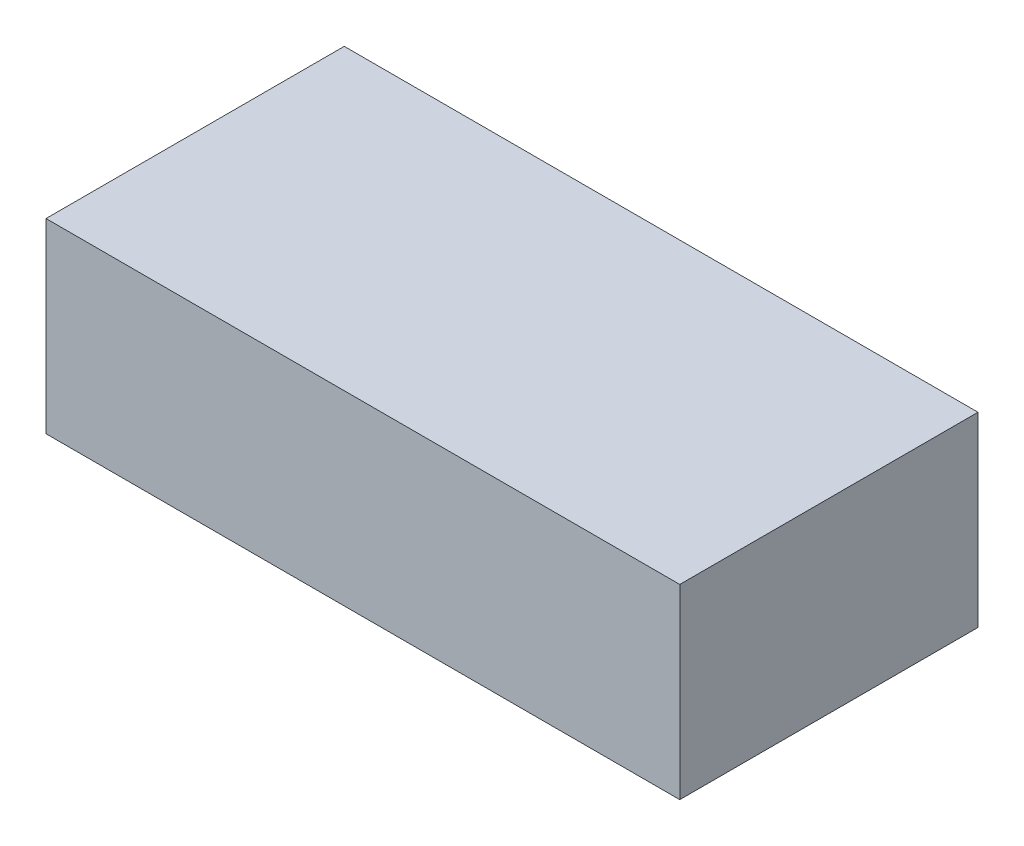
ISO-10303-21;
HEADER;
FILE_DESCRIPTION(('STEP AP214'),'2;1');
FILE_NAME('part.step','',(''),(''),'','','');
FILE_SCHEMA(('AUTOMOTIVE_DESIGN { 1 0 10303 214 1 1 1 1 }'));
ENDSEC;
DATA;
#1=APPLICATION_CONTEXT('core data for automotive mechanical design processes');
#2=APPLICATION_PROTOCOL_DEFINITION('international standard','automotive_design',2000,#1);
#3=PRODUCT_CONTEXT('',#1,'mechanical');
#4=PRODUCT('Part','Part','',(#3));
#5=PRODUCT_RELATED_PRODUCT_CATEGORY('part','',(#4));
#6=PRODUCT_DEFINITION_FORMATION('','',#4);
#7=PRODUCT_DEFINITION_CONTEXT('part definition',#1,'design');
#8=PRODUCT_DEFINITION('design','',#6,#7);
#9=PRODUCT_DEFINITION_SHAPE('','',#8);
#10=(LENGTH_UNIT() NAMED_UNIT(*) SI_UNIT(.MILLI.,.METRE.));
#11=(NAMED_UNIT(*) PLANE_ANGLE_UNIT() SI_UNIT($,.RADIAN.));
#12=(NAMED_UNIT(*) SI_UNIT($,.STERADIAN.) SOLID_ANGLE_UNIT());
#13=UNCERTAINTY_MEASURE_WITH_UNIT(LENGTH_MEASURE(1.E-05),#10,'distance_accuracy_value','');
#14=(GEOMETRIC_REPRESENTATION_CONTEXT(3) GLOBAL_UNCERTAINTY_ASSIGNED_CONTEXT((#13)) GLOBAL_UNIT_ASSIGNED_CONTEXT((#10,
#11,#12)) REPRESENTATION_CONTEXT('',''));
#15=CARTESIAN_POINT('',(0.,0.,0.));
#16=DIRECTION('',(0.,0.,1.));
#17=DIRECTION('',(1.,0.,0.));
#18=AXIS2_PLACEMENT_3D('',#15,#16,#17);
#19=CARTESIAN_POINT('',(-6.08470453258748,129.862251837422,80.));
#20=DIRECTION('',(1.,0.,0.));
#21=DIRECTION('',(0.,1.,0.));
#22=AXIS2_PLACEMENT_3D('',#19,#20,#21);
#23=PLANE('',#22);
#24=DIRECTION('',(0.,-1.,0.));
#25=VECTOR('',#24,1.);
#26=CARTESIAN_POINT('',(-6.08470453258748,129.862251837422,0.));
#27=LINE('',#26,#25);
#28=CARTESIAN_POINT('',(-6.08470453258748,129.862251837422,0.));
#29=VERTEX_POINT('',#28);
#30=CARTESIAN_POINT('',(-6.08470453258747,79.8622518374218,0.));
#31=VERTEX_POINT('',#30);
#32=EDGE_CURVE('E100',#29,#31,#27,.T.);
#33=ORIENTED_EDGE('',*,*,#32,.T.);
#34=DIRECTION('',(0.,0.,-1.));
#35=VECTOR('',#34,1.);
#36=CARTESIAN_POINT('',(-6.08470453258747,79.8622518374218,80.));
#37=LINE('',#36,#35);
#38=CARTESIAN_POINT('',(-6.08470453258747,79.8622518374218,80.));
#39=VERTEX_POINT('',#38);
#40=EDGE_CURVE('E11',#39,#31,#37,.T.);
#41=ORIENTED_EDGE('',*,*,#40,.F.);
#42=DIRECTION('',(0.,-1.,0.));
#43=VECTOR('',#42,1.);
#44=CARTESIAN_POINT('',(-6.08470453258748,129.862251837422,80.));
#45=LINE('',#44,#43);
#46=CARTESIAN_POINT('',(-6.08470453258748,129.862251837422,80.));
#47=VERTEX_POINT('',#46);
#48=EDGE_CURVE('E88',#47,#39,#45,.T.);
#49=ORIENTED_EDGE('',*,*,#48,.F.);
#50=DIRECTION('',(0.,0.,-1.));
#51=VECTOR('',#50,1.);
#52=CARTESIAN_POINT('',(-6.08470453258748,129.862251837422,80.));
#53=LINE('',#52,#51);
#54=EDGE_CURVE('E96',#47,#29,#53,.T.);
#55=ORIENTED_EDGE('',*,*,#54,.T.);
#56=EDGE_LOOP('',(#33,#41,#49,#55));
#57=FACE_BOUND('',#56,.T.);
#58=ADVANCED_FACE('F37',(#57),#23,.F.);
#59=CARTESIAN_POINT('',(-6.08470453258747,79.8622518374218,80.));
#60=DIRECTION('',(0.,1.,0.));
#61=DIRECTION('',(0.,0.,1.));
#62=AXIS2_PLACEMENT_3D('',#59,#60,#61);
#63=PLANE('',#62);
#64=DIRECTION('',(1.,0.,0.));
#65=VECTOR('',#64,1.);
#66=CARTESIAN_POINT('',(-6.08470453258747,79.8622518374218,0.));
#67=LINE('',#66,#65);
#68=CARTESIAN_POINT('',(163.915295467413,79.8622518374218,0.));
#69=VERTEX_POINT('',#68);
#70=EDGE_CURVE('E92',#31,#69,#67,.T.);
#71=ORIENTED_EDGE('',*,*,#70,.T.);
#72=DIRECTION('',(0.,0.,-1.));
#73=VECTOR('',#72,1.);
#74=CARTESIAN_POINT('',(163.915295467413,79.8622518374218,80.));
#75=LINE('',#74,#73);
#76=CARTESIAN_POINT('',(163.915295467413,79.8622518374218,80.));
#77=VERTEX_POINT('',#76);
#78=EDGE_CURVE('E45',#77,#69,#75,.T.);
#79=ORIENTED_EDGE('',*,*,#78,.F.);
#80=DIRECTION('',(1.,0.,0.));
#81=VECTOR('',#80,1.);
#82=CARTESIAN_POINT('',(-6.08470453258747,79.8622518374218,80.));
#83=LINE('',#82,#81);
#84=EDGE_CURVE('E83',#39,#77,#83,.T.);
#85=ORIENTED_EDGE('',*,*,#84,.F.);
#86=ORIENTED_EDGE('',*,*,#40,.T.);
#87=EDGE_LOOP('',(#71,#79,#85,#86));
#88=FACE_BOUND('',#87,.T.);
#89=ADVANCED_FACE('F91',(#88),#63,.F.);
#90=CARTESIAN_POINT('',(163.915295467413,129.862251837422,80.));
#91=DIRECTION('',(-1.,0.,0.));
#92=DIRECTION('',(0.,0.,1.));
#93=AXIS2_PLACEMENT_3D('',#90,#91,#92);
#94=PLANE('',#93);
#95=DIRECTION('',(0.,1.,0.));
#96=VECTOR('',#95,1.);
#97=CARTESIAN_POINT('',(163.915295467413,129.862251837422,0.));
#98=LINE('',#97,#96);
#99=CARTESIAN_POINT('',(163.915295467413,129.862251837422,0.));
#100=VERTEX_POINT('',#99);
#101=EDGE_CURVE('E70',#69,#100,#98,.T.);
#102=ORIENTED_EDGE('',*,*,#101,.T.);
#103=DIRECTION('',(0.,0.,-1.));
#104=VECTOR('',#103,1.);
#105=CARTESIAN_POINT('',(163.915295467413,129.862251837422,80.));
#106=LINE('',#105,#104);
#107=CARTESIAN_POINT('',(163.915295467413,129.862251837422,80.));
#108=VERTEX_POINT('',#107);
#109=EDGE_CURVE('E93',#108,#100,#106,.T.);
#110=ORIENTED_EDGE('',*,*,#109,.F.);
#111=DIRECTION('',(0.,1.,0.));
#112=VECTOR('',#111,1.);
#113=CARTESIAN_POINT('',(163.915295467413,129.862251837422,80.));
#114=LINE('',#113,#112);
#115=EDGE_CURVE('E86',#77,#108,#114,.T.);
#116=ORIENTED_EDGE('',*,*,#115,.F.);
#117=ORIENTED_EDGE('',*,*,#78,.T.);
#118=EDGE_LOOP('',(#102,#110,#116,#117));
#119=FACE_BOUND('',#118,.T.);
#120=ADVANCED_FACE('F94',(#119),#94,.F.);
#121=CARTESIAN_POINT('',(-6.08470453258748,129.862251837422,80.));
#122=DIRECTION('',(0.,-1.,0.));
#123=DIRECTION('',(0.,0.,-1.));
#124=AXIS2_PLACEMENT_3D('',#121,#122,#123);
#125=PLANE('',#124);
#126=DIRECTION('',(-1.,0.,0.));
#127=VECTOR('',#126,1.);
#128=CARTESIAN_POINT('',(-6.08470453258748,129.862251837422,0.));
#129=LINE('',#128,#127);
#130=EDGE_CURVE('E76',#100,#29,#129,.T.);
#131=ORIENTED_EDGE('',*,*,#130,.T.);
#132=ORIENTED_EDGE('',*,*,#54,.F.);
#133=DIRECTION('',(-1.,0.,0.));
#134=VECTOR('',#133,1.);
#135=CARTESIAN_POINT('',(-6.08470453258748,129.862251837422,80.));
#136=LINE('',#135,#134);
#137=EDGE_CURVE('E53',#108,#47,#136,.T.);
#138=ORIENTED_EDGE('',*,*,#137,.F.);
#139=ORIENTED_EDGE('',*,*,#109,.T.);
#140=EDGE_LOOP('',(#131,#132,#138,#139));
#141=FACE_BOUND('',#140,.T.);
#142=ADVANCED_FACE('F107',(#141),#125,.F.);
#143=CARTESIAN_POINT('',(0.,0.,80.));
#144=DIRECTION('',(0.,0.,1.));
#145=DIRECTION('',(1.,0.,0.));
#146=AXIS2_PLACEMENT_3D('',#143,#144,#145);
#147=PLANE('',#146);
#148=ORIENTED_EDGE('',*,*,#48,.T.);
#149=ORIENTED_EDGE('',*,*,#84,.T.);
#150=ORIENTED_EDGE('',*,*,#115,.T.);
#151=ORIENTED_EDGE('',*,*,#137,.T.);
#152=EDGE_LOOP('',(#148,#149,#150,#151));
#153=FACE_BOUND('',#152,.T.);
#154=ADVANCED_FACE('F84',(#153),#147,.T.);
#155=CARTESIAN_POINT('',(0.,0.,0.));
#156=DIRECTION('',(0.,0.,1.));
#157=DIRECTION('',(1.,0.,0.));
#158=AXIS2_PLACEMENT_3D('',#155,#156,#157);
#159=PLANE('',#158);
#160=ORIENTED_EDGE('',*,*,#32,.F.);
#161=ORIENTED_EDGE('',*,*,#130,.F.);
#162=ORIENTED_EDGE('',*,*,#101,.F.);
#163=ORIENTED_EDGE('',*,*,#70,.F.);
#164=EDGE_LOOP('',(#160,#161,#162,#163));
#165=FACE_BOUND('',#164,.T.);
#166=ADVANCED_FACE('F110',(#165),#159,.F.);
#167=CLOSED_SHELL('',(#58,#89,#120,#142,#154,#166));
#168=MANIFOLD_SOLID_BREP('B2',#167);
#169=ADVANCED_BREP_SHAPE_REPRESENTATION('',(#18,#168),#14);
#170=SHAPE_DEFINITION_REPRESENTATION(#9,#169);
ENDSEC;
END-ISO-10303-21;
